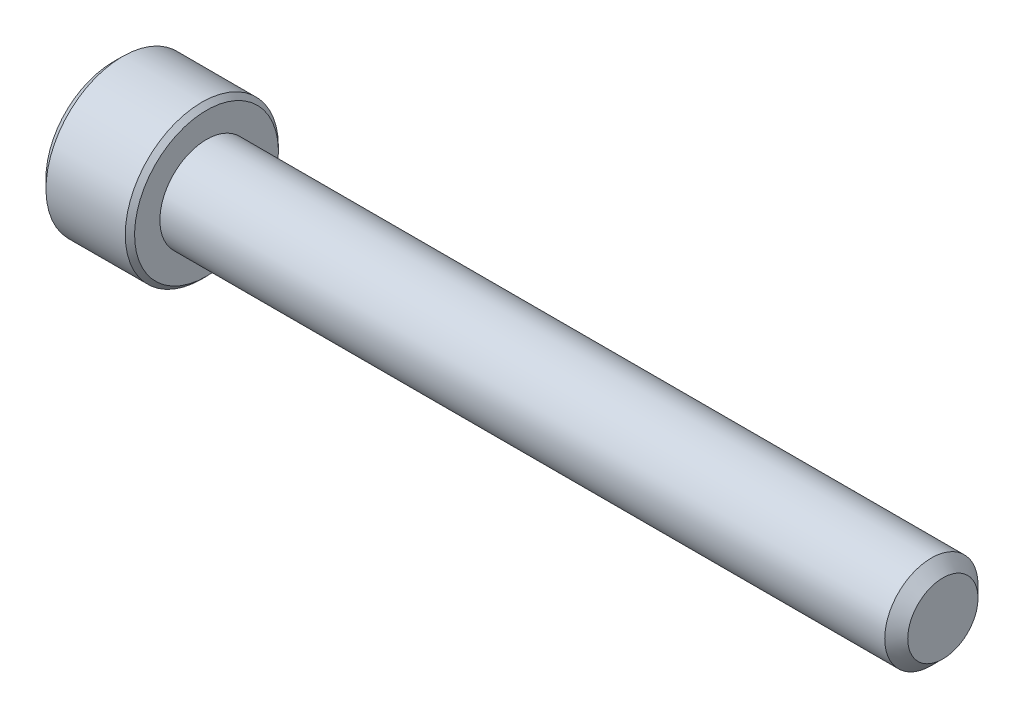
ISO-10303-21;
HEADER;
FILE_DESCRIPTION(('STEP AP214'),'2;1');
FILE_NAME('part.step','',(''),(''),'','','');
FILE_SCHEMA(('AUTOMOTIVE_DESIGN { 1 0 10303 214 1 1 1 1 }'));
ENDSEC;
DATA;
#1=APPLICATION_CONTEXT('core data for automotive mechanical design processes');
#2=APPLICATION_PROTOCOL_DEFINITION('international standard','automotive_design',2000,#1);
#3=PRODUCT_CONTEXT('',#1,'mechanical');
#4=PRODUCT('Part','Part','',(#3));
#5=PRODUCT_RELATED_PRODUCT_CATEGORY('part','',(#4));
#6=PRODUCT_DEFINITION_FORMATION('','',#4);
#7=PRODUCT_DEFINITION_CONTEXT('part definition',#1,'design');
#8=PRODUCT_DEFINITION('design','',#6,#7);
#9=PRODUCT_DEFINITION_SHAPE('','',#8);
#10=(LENGTH_UNIT() NAMED_UNIT(*) SI_UNIT(.MILLI.,.METRE.));
#11=(NAMED_UNIT(*) PLANE_ANGLE_UNIT() SI_UNIT($,.RADIAN.));
#12=(NAMED_UNIT(*) SI_UNIT($,.STERADIAN.) SOLID_ANGLE_UNIT());
#13=UNCERTAINTY_MEASURE_WITH_UNIT(LENGTH_MEASURE(1.E-05),#10,'distance_accuracy_value','');
#14=(GEOMETRIC_REPRESENTATION_CONTEXT(3) GLOBAL_UNCERTAINTY_ASSIGNED_CONTEXT((#13)) GLOBAL_UNIT_ASSIGNED_CONTEXT((#10,
#11,#12)) REPRESENTATION_CONTEXT('',''));
#15=CARTESIAN_POINT('',(0.,0.,0.));
#16=DIRECTION('',(0.,0.,1.));
#17=DIRECTION('',(1.,0.,0.));
#18=AXIS2_PLACEMENT_3D('',#15,#16,#17);
#19=CARTESIAN_POINT('',(-21.59,2.28769270663697,0.));
#20=DIRECTION('',(1.,0.,0.));
#21=DIRECTION('',(0.,0.,-1.));
#22=AXIS2_PLACEMENT_3D('',#19,#20,#21);
#23=PLANE('',#22);
#24=DIRECTION('',(0.,1.,0.));
#25=VECTOR('',#24,1.);
#26=CARTESIAN_POINT('',(-21.59,-1.14384635331849,-1.9812));
#27=LINE('',#26,#25);
#28=CARTESIAN_POINT('',(-21.59,-1.14384635331849,-1.9812));
#29=VERTEX_POINT('',#28);
#30=CARTESIAN_POINT('',(-21.59,1.14384635331849,-1.9812));
#31=VERTEX_POINT('',#30);
#32=EDGE_CURVE('E90',#29,#31,#27,.T.);
#33=ORIENTED_EDGE('',*,*,#32,.F.);
#34=DIRECTION('',(0.,-0.5,0.866025403784439));
#35=VECTOR('',#34,1.);
#36=CARTESIAN_POINT('',(-21.59,-2.28769270663697,0.));
#37=LINE('',#36,#35);
#38=CARTESIAN_POINT('',(-21.59,-2.28769270663692,0.));
#39=VERTEX_POINT('',#38);
#40=EDGE_CURVE('E88',#39,#29,#37,.F.);
#41=ORIENTED_EDGE('',*,*,#40,.F.);
#42=DIRECTION('',(0.,0.5,0.866025403784439));
#43=VECTOR('',#42,1.);
#44=CARTESIAN_POINT('',(-21.59,-1.14384635331849,1.9812));
#45=LINE('',#44,#43);
#46=CARTESIAN_POINT('',(-21.59,-1.14384635331849,1.9812));
#47=VERTEX_POINT('',#46);
#48=EDGE_CURVE('E68',#47,#39,#45,.F.);
#49=ORIENTED_EDGE('',*,*,#48,.F.);
#50=DIRECTION('',(0.,1.,0.));
#51=VECTOR('',#50,1.);
#52=CARTESIAN_POINT('',(-21.59,1.14384635331849,1.9812));
#53=LINE('',#52,#51);
#54=CARTESIAN_POINT('',(-21.59,1.14384635331848,1.9812));
#55=VERTEX_POINT('',#54);
#56=EDGE_CURVE('E107',#55,#47,#53,.F.);
#57=ORIENTED_EDGE('',*,*,#56,.F.);
#58=DIRECTION('',(0.,0.5,-0.866025403784439));
#59=VECTOR('',#58,1.);
#60=CARTESIAN_POINT('',(-21.59,2.28769270663697,0.));
#61=LINE('',#60,#59);
#62=CARTESIAN_POINT('',(-21.59,2.28769270663698,0.));
#63=VERTEX_POINT('',#62);
#64=EDGE_CURVE('E73',#63,#55,#61,.F.);
#65=ORIENTED_EDGE('',*,*,#64,.F.);
#66=DIRECTION('',(0.,-0.5,-0.866025403784439));
#67=VECTOR('',#66,1.);
#68=CARTESIAN_POINT('',(-21.59,1.14384635331849,-1.9812));
#69=LINE('',#68,#67);
#70=EDGE_CURVE('E115',#31,#63,#69,.F.);
#71=ORIENTED_EDGE('',*,*,#70,.F.);
#72=EDGE_LOOP('',(#33,#41,#49,#57,#65,#71));
#73=FACE_BOUND('',#72,.T.);
#74=ADVANCED_FACE('F17',(#73),#23,.F.);
#75=CARTESIAN_POINT('',(-21.59,-1.14384635331849,1.9812));
#76=DIRECTION('',(0.,0.866025403784439,-0.5));
#77=DIRECTION('',(0.,0.5,0.866025403784439));
#78=AXIS2_PLACEMENT_3D('',#75,#76,#77);
#79=PLANE('',#78);
#80=ORIENTED_EDGE('',*,*,#48,.T.);
#81=DIRECTION('',(1.,0.,0.));
#82=VECTOR('',#81,1.);
#83=CARTESIAN_POINT('',(-21.59,-2.2876927066369,-1.24131463938126E-13));
#84=LINE('',#83,#82);
#85=CARTESIAN_POINT('',(-23.8759999999097,-2.28769270665268,0.));
#86=VERTEX_POINT('',#85);
#87=EDGE_CURVE('E58',#86,#39,#84,.T.);
#88=ORIENTED_EDGE('',*,*,#87,.F.);
#89=CARTESIAN_POINT('',(-23.875999999917,-2.28769270663649,-3.23909531910409E-11));
#90=CARTESIAN_POINT('',(-23.8367231715198,-2.24837814885391,0.0680948115454177));
#91=CARTESIAN_POINT('',(-23.7997535182681,-2.20840625085198,0.137328169768456));
#92=CARTESIAN_POINT('',(-23.7320636614104,-2.12689944881423,0.278502092066733));
#93=CARTESIAN_POINT('',(-23.7013811081117,-2.08535679771273,0.350456074453279));
#94=CARTESIAN_POINT('',(-23.6488216878646,-2.0015880794742,0.495547750525627));
#95=CARTESIAN_POINT('',(-23.626812750451,-1.95938333420538,0.568648513652342));
#96=CARTESIAN_POINT('',(-23.592903790448,-1.87404496431856,0.716458906131875));
#97=CARTESIAN_POINT('',(-23.5809784655905,-1.83091394479085,0.791164023335938));
#98=CARTESIAN_POINT('',(-23.5702184619894,-1.75657564565178,0.919921734392981));
#99=CARTESIAN_POINT('',(-23.5686261142532,-1.7254643369951,0.97380810167633));
#100=CARTESIAN_POINT('',(-23.5713122030608,-1.66329262280389,1.08149266944917));
#101=CARTESIAN_POINT('',(-23.5755926973669,-1.63223223893117,1.13529083241932));
#102=CARTESIAN_POINT('',(-23.5897808786528,-1.570404805932,1.24237908767543));
#103=CARTESIAN_POINT('',(-23.5996948571084,-1.53963812394019,1.29566854406557));
#104=CARTESIAN_POINT('',(-23.6246058236765,-1.47863680820632,1.40132592224517));
#105=CARTESIAN_POINT('',(-23.6396024219634,-1.44840213384748,1.45369391438499));
#106=CARTESIAN_POINT('',(-23.684112301289,-1.37097621851473,1.58779953356383));
#107=CARTESIAN_POINT('',(-23.7169769783748,-1.32426457014328,1.66870648184849));
#108=CARTESIAN_POINT('',(-23.7724554571065,-1.25557868183891,1.78767393015465));
#109=CARTESIAN_POINT('',(-23.7919477927592,-1.23294354217948,1.82687914208121));
#110=CARTESIAN_POINT('',(-23.8327090770897,-1.18809237506183,1.90456364230774));
#111=CARTESIAN_POINT('',(-23.8539769369534,-1.16587610084023,1.94304335801443));
#112=CARTESIAN_POINT('',(-23.875999999909,-1.14384635330347,1.981200000026));
#113=B_SPLINE_CURVE_WITH_KNOTS('',3,(#89,#90,#91,#92,#93,#94,#95,#96,#97,#98,#99,#100,#101,#102,
#103,#104,#105,#106,#107,#108,#109,#110,#111,#112),.UNSPECIFIED.,.F.,.F.,(4,2,2,2,2,2,2,2,2,2,2,
4),(0.,0.263862053771174,0.529260821963846,0.790445955100976,1.05097374894045,1.23743842676391,
1.42396845590621,1.61070721238151,1.79743164964573,2.0939158774145,2.24175583204643,
2.3895057827315),.UNSPECIFIED.);
#114=CARTESIAN_POINT('',(-23.8759999999129,-1.14384635333276,1.98120000001359));
#115=VERTEX_POINT('',#114);
#116=EDGE_CURVE('E20',#86,#115,#113,.T.);
#117=ORIENTED_EDGE('',*,*,#116,.T.);
#118=DIRECTION('',(-1.,0.,0.));
#119=VECTOR('',#118,1.);
#120=CARTESIAN_POINT('',(-21.59,-1.14384635331849,1.9812));
#121=LINE('',#120,#119);
#122=EDGE_CURVE('E84',#47,#115,#121,.T.);
#123=ORIENTED_EDGE('',*,*,#122,.F.);
#124=EDGE_LOOP('',(#80,#88,#117,#123));
#125=FACE_BOUND('',#124,.T.);
#126=ADVANCED_FACE('F83',(#125),#79,.T.);
#127=CARTESIAN_POINT('',(-21.59,-2.28769270663697,0.));
#128=DIRECTION('',(0.,0.866025403784439,0.5));
#129=DIRECTION('',(0.,-0.5,0.866025403784439));
#130=AXIS2_PLACEMENT_3D('',#127,#128,#129);
#131=PLANE('',#130);
#132=ORIENTED_EDGE('',*,*,#40,.T.);
#133=DIRECTION('',(1.,0.,0.));
#134=VECTOR('',#133,1.);
#135=CARTESIAN_POINT('',(-21.59,-1.14384635331849,-1.9812));
#136=LINE('',#135,#134);
#137=CARTESIAN_POINT('',(-23.8759999999097,-1.14384635332635,-1.98120000001361));
#138=VERTEX_POINT('',#137);
#139=EDGE_CURVE('E93',#138,#29,#136,.T.);
#140=ORIENTED_EDGE('',*,*,#139,.F.);
#141=CARTESIAN_POINT('',(-23.8759999999169,-1.14384635329023,-1.98120000001579));
#142=CARTESIAN_POINT('',(-23.8367231715197,-1.18316091109122,-1.9131051884486));
#143=CARTESIAN_POINT('',(-23.799753518268,-1.22313280910071,-1.84387183022993));
#144=CARTESIAN_POINT('',(-23.7320636614104,-1.30463961114402,-1.70269790793487));
#145=CARTESIAN_POINT('',(-23.7013811081117,-1.34618226224348,-1.63074392554714));
#146=CARTESIAN_POINT('',(-23.6488216878646,-1.42995098048053,-1.48565224947395));
#147=CARTESIAN_POINT('',(-23.626812750451,-1.47215572574988,-1.41255148634755));
#148=CARTESIAN_POINT('',(-23.592903790448,-1.55749409563709,-1.26474109386824));
#149=CARTESIAN_POINT('',(-23.5809784655905,-1.60062511516465,-1.1900359766641));
#150=CARTESIAN_POINT('',(-23.5702184619894,-1.67496341430364,-1.06127826560701));
#151=CARTESIAN_POINT('',(-23.5686261142532,-1.70607472296034,-1.00739189832368));
#152=CARTESIAN_POINT('',(-23.5713122030608,-1.76824643715157,-0.899707330550847));
#153=CARTESIAN_POINT('',(-23.5755926973669,-1.79930682102429,-0.845909167580694));
#154=CARTESIAN_POINT('',(-23.5897808786528,-1.86113425402345,-0.738820912324577));
#155=CARTESIAN_POINT('',(-23.5996948571084,-1.89190093601526,-0.685531455934445));
#156=CARTESIAN_POINT('',(-23.6246058236766,-1.95290225174913,-0.57987407775484));
#157=CARTESIAN_POINT('',(-23.6396024219634,-1.98313692610798,-0.527506085615018));
#158=CARTESIAN_POINT('',(-23.684112301289,-2.06056284144072,-0.393400466436183));
#159=CARTESIAN_POINT('',(-23.7169769783748,-2.10727448981218,-0.312493518151523));
#160=CARTESIAN_POINT('',(-23.7724554571065,-2.17596037811654,-0.19352606984536));
#161=CARTESIAN_POINT('',(-23.7919477927592,-2.19859551777598,-0.154320857918803));
#162=CARTESIAN_POINT('',(-23.8327090770897,-2.24344668489363,-0.0766363576922705));
#163=CARTESIAN_POINT('',(-23.8539769369534,-2.26566295911523,-0.0381566419855778));
#164=CARTESIAN_POINT('',(-23.875999999909,-2.28769270665198,2.59943070280544E-11));
#165=B_SPLINE_CURVE_WITH_KNOTS('',3,(#141,#142,#143,#144,#145,#146,#147,#148,#149,#150,#151,
#152,#153,#154,#155,#156,#157,#158,#159,#160,#161,#162,#163,#164),.UNSPECIFIED.,.F.,.F.,(4,2,2,
2,2,2,2,2,2,2,2,4),(0.,0.263862053771165,0.529260821963824,0.790445955100943,1.05097374894041,
1.23743842676387,1.42396845590617,1.61070721238147,1.79743164964569,2.09391587741446,
2.2417558320464,2.38950578273147),.UNSPECIFIED.);
#166=EDGE_CURVE('E97',#138,#86,#165,.T.);
#167=ORIENTED_EDGE('',*,*,#166,.T.);
#168=ORIENTED_EDGE('',*,*,#87,.T.);
#169=EDGE_LOOP('',(#132,#140,#167,#168));
#170=FACE_BOUND('',#169,.T.);
#171=ADVANCED_FACE('F95',(#170),#131,.T.);
#172=CARTESIAN_POINT('',(-21.59,-1.14384635331849,-1.9812));
#173=DIRECTION('',(0.,0.,1.));
#174=DIRECTION('',(1.,0.,0.));
#175=AXIS2_PLACEMENT_3D('',#172,#173,#174);
#176=PLANE('',#175);
#177=ORIENTED_EDGE('',*,*,#32,.T.);
#178=DIRECTION('',(1.,0.,0.));
#179=VECTOR('',#178,1.);
#180=CARTESIAN_POINT('',(-21.59,1.14384635331848,-1.9812));
#181=LINE('',#180,#179);
#182=CARTESIAN_POINT('',(-23.8759999999096,1.14384635332635,-1.98120000001362));
#183=VERTEX_POINT('',#182);
#184=EDGE_CURVE('E117',#183,#31,#181,.T.);
#185=ORIENTED_EDGE('',*,*,#184,.F.);
#186=CARTESIAN_POINT('',(-23.8759999999169,1.14384635334631,-1.98119999998342));
#187=CARTESIAN_POINT('',(-23.8367231715197,1.06521723776272,-1.98119999999403));
#188=CARTESIAN_POINT('',(-23.799753518268,0.985273441751297,-1.9811999999984));
#189=CARTESIAN_POINT('',(-23.7320636614104,0.822259837670227,-1.98120000000161));
#190=CARTESIAN_POINT('',(-23.7013811081117,0.73917453546927,-1.98120000000043));
#191=CARTESIAN_POINT('',(-23.6488216878645,0.571637098993696,-1.98119999999958));
#192=CARTESIAN_POINT('',(-23.626812750451,0.487227608455526,-1.98119999999989));
#193=CARTESIAN_POINT('',(-23.5929037904479,0.316550868681495,-1.98120000000011));
#194=CARTESIAN_POINT('',(-23.5809784655905,0.230288829626232,-1.98120000000002));
#195=CARTESIAN_POINT('',(-23.5702184619894,0.0816122313481629,-1.98119999999998));
#196=CARTESIAN_POINT('',(-23.5686261142532,0.0193896140347859,-1.98119999999999));
#197=CARTESIAN_POINT('',(-23.5713122030608,-0.104953814347641,-1.9812));
#198=CARTESIAN_POINT('',(-23.5755926973668,-0.167074582093088,-1.9812));
#199=CARTESIAN_POINT('',(-23.5897808786528,-0.290729448091418,-1.9812));
#200=CARTESIAN_POINT('',(-23.5996948571084,-0.35226281207504,-1.9812));
#201=CARTESIAN_POINT('',(-23.6246058236765,-0.47426544354277,-1.9812));
#202=CARTESIAN_POINT('',(-23.6396024219633,-0.534734792260462,-1.9812));
#203=CARTESIAN_POINT('',(-23.684112301289,-0.689586622925962,-1.9812));
#204=CARTESIAN_POINT('',(-23.7169769783748,-0.783009919668897,-1.9812));
#205=CARTESIAN_POINT('',(-23.7724554571065,-0.920381696277656,-1.9812));
#206=CARTESIAN_POINT('',(-23.7919477927592,-0.965651975596532,-1.9812));
#207=CARTESIAN_POINT('',(-23.8327090770897,-1.05535430983185,-1.9812));
#208=CARTESIAN_POINT('',(-23.8539769369534,-1.09978685827506,-1.9812));
#209=CARTESIAN_POINT('',(-23.875999999909,-1.14384635334857,-1.9812));
#210=B_SPLINE_CURVE_WITH_KNOTS('',3,(#186,#187,#188,#189,#190,#191,#192,#193,#194,#195,#196,
#197,#198,#199,#200,#201,#202,#203,#204,#205,#206,#207,#208,#209),.UNSPECIFIED.,.F.,.F.,(4,2,2,
2,2,2,2,2,2,2,2,4),(0.,0.263862053771165,0.529260821963828,0.790445955100947,1.05097374894041,
1.23743842676387,1.42396845590617,1.61070721238147,1.79743164964569,2.09391587741451,
2.24175583204647,2.38950578273157),.UNSPECIFIED.);
#211=EDGE_CURVE('E199',#183,#138,#210,.T.);
#212=ORIENTED_EDGE('',*,*,#211,.T.);
#213=ORIENTED_EDGE('',*,*,#139,.T.);
#214=EDGE_LOOP('',(#177,#185,#212,#213));
#215=FACE_BOUND('',#214,.T.);
#216=ADVANCED_FACE('F188',(#215),#176,.T.);
#217=CARTESIAN_POINT('',(-21.59,1.14384635331849,-1.9812));
#218=DIRECTION('',(0.,-0.866025403784439,0.5));
#219=DIRECTION('',(0.,-0.5,-0.866025403784439));
#220=AXIS2_PLACEMENT_3D('',#217,#218,#219);
#221=PLANE('',#220);
#222=ORIENTED_EDGE('',*,*,#70,.T.);
#223=DIRECTION('',(1.,0.,0.));
#224=VECTOR('',#223,1.);
#225=CARTESIAN_POINT('',(-21.59,2.28769270663699,0.));
#226=LINE('',#225,#224);
#227=CARTESIAN_POINT('',(-23.8759999999096,2.28769270665271,0.));
#228=VERTEX_POINT('',#227);
#229=EDGE_CURVE('E112',#228,#63,#226,.T.);
#230=ORIENTED_EDGE('',*,*,#229,.F.);
#231=CARTESIAN_POINT('',(-23.8759999999169,2.28769270663654,3.23803637195144E-11));
#232=CARTESIAN_POINT('',(-23.8367231715197,2.24837814885393,-0.068094811545418));
#233=CARTESIAN_POINT('',(-23.799753518268,2.20840625085199,-0.137328169768451));
#234=CARTESIAN_POINT('',(-23.7320636614103,2.12689944881423,-0.278502092066724));
#235=CARTESIAN_POINT('',(-23.7013811081116,2.08535679771273,-0.350456074453271));
#236=CARTESIAN_POINT('',(-23.6488216878645,2.00158807947421,-0.495547750525619));
#237=CARTESIAN_POINT('',(-23.6268127504509,1.95938333420539,-0.568648513652333));
#238=CARTESIAN_POINT('',(-23.5929037904479,1.87404496431856,-0.716458906131865));
#239=CARTESIAN_POINT('',(-23.5809784655904,1.83091394479086,-0.791164023335926));
#240=CARTESIAN_POINT('',(-23.5702184619893,1.75657564565178,-0.919921734392968));
#241=CARTESIAN_POINT('',(-23.5686261142531,1.72546433699511,-0.973808101676315));
#242=CARTESIAN_POINT('',(-23.5713122030607,1.6632926228039,-1.08149266944915));
#243=CARTESIAN_POINT('',(-23.5755926973668,1.63223223893118,-1.1352908324193));
#244=CARTESIAN_POINT('',(-23.5897808786527,1.57040480593201,-1.24237908767541));
#245=CARTESIAN_POINT('',(-23.5996948571083,1.5396381239402,-1.29566854406554));
#246=CARTESIAN_POINT('',(-23.6246058236765,1.47863680820634,-1.40132592224515));
#247=CARTESIAN_POINT('',(-23.6396024219633,1.44840213384749,-1.45369391438497));
#248=CARTESIAN_POINT('',(-23.684112301289,1.37097621851474,-1.58779953356382));
#249=CARTESIAN_POINT('',(-23.7169769783747,1.32426457014327,-1.6687064818485));
#250=CARTESIAN_POINT('',(-23.7724554571065,1.25557868183889,-1.78767393015469));
#251=CARTESIAN_POINT('',(-23.7919477927591,1.23294354217945,-1.82687914208125));
#252=CARTESIAN_POINT('',(-23.8327090770897,1.18809237506179,-1.9045636423078));
#253=CARTESIAN_POINT('',(-23.8539769369534,1.16587610084019,-1.9430433580145));
#254=CARTESIAN_POINT('',(-23.875999999909,1.14384635330343,-1.98120000002608));
#255=B_SPLINE_CURVE_WITH_KNOTS('',3,(#231,#232,#233,#234,#235,#236,#237,#238,#239,#240,#241,
#242,#243,#244,#245,#246,#247,#248,#249,#250,#251,#252,#253,#254),.UNSPECIFIED.,.F.,.F.,(4,2,2,
2,2,2,2,2,2,2,2,4),(0.,0.26386205377117,0.529260821963842,0.790445955100968,1.05097374894044,
1.23743842676389,1.42396845590619,1.61070721238149,1.79743164964571,2.09391587741454,
2.24175583204651,2.38950578273161),.UNSPECIFIED.);
#256=EDGE_CURVE('E192',#228,#183,#255,.T.);
#257=ORIENTED_EDGE('',*,*,#256,.T.);
#258=ORIENTED_EDGE('',*,*,#184,.T.);
#259=EDGE_LOOP('',(#222,#230,#257,#258));
#260=FACE_BOUND('',#259,.T.);
#261=ADVANCED_FACE('F184',(#260),#221,.T.);
#262=CARTESIAN_POINT('',(-21.59,2.28769270663697,0.));
#263=DIRECTION('',(0.,-0.866025403784439,-0.5));
#264=DIRECTION('',(0.,0.5,-0.866025403784439));
#265=AXIS2_PLACEMENT_3D('',#262,#263,#264);
#266=PLANE('',#265);
#267=ORIENTED_EDGE('',*,*,#64,.T.);
#268=DIRECTION('',(-1.,0.,0.));
#269=VECTOR('',#268,1.);
#270=CARTESIAN_POINT('',(-21.59,1.14384635331848,1.9812));
#271=LINE('',#270,#269);
#272=CARTESIAN_POINT('',(-23.8759999999096,1.14384635332635,1.98120000001363));
#273=VERTEX_POINT('',#272);
#274=EDGE_CURVE('E39',#273,#55,#271,.F.);
#275=ORIENTED_EDGE('',*,*,#274,.F.);
#276=CARTESIAN_POINT('',(-23.8759999999169,1.14384635329021,1.98120000001581));
#277=CARTESIAN_POINT('',(-23.8367231715197,1.1831609110912,1.91310518844862));
#278=CARTESIAN_POINT('',(-23.799753518268,1.22313280910069,1.84387183022995));
#279=CARTESIAN_POINT('',(-23.7320636614103,1.30463961114402,1.70269790793488));
#280=CARTESIAN_POINT('',(-23.7013811081116,1.34618226224347,1.63074392554715));
#281=CARTESIAN_POINT('',(-23.6488216878645,1.42995098048053,1.48565224947395));
#282=CARTESIAN_POINT('',(-23.626812750451,1.47215572574988,1.41255148634754));
#283=CARTESIAN_POINT('',(-23.5929037904479,1.5574940956371,1.26474109386823));
#284=CARTESIAN_POINT('',(-23.5809784655905,1.60062511516466,1.19003597666408));
#285=CARTESIAN_POINT('',(-23.5702184619893,1.67496341430366,1.06127826560699));
#286=CARTESIAN_POINT('',(-23.5686261142531,1.70607472296036,1.00739189832365));
#287=CARTESIAN_POINT('',(-23.5713122030607,1.76824643715158,0.899707330550826));
#288=CARTESIAN_POINT('',(-23.5755926973668,1.7993068210243,0.845909167580675));
#289=CARTESIAN_POINT('',(-23.5897808786527,1.86113425402346,0.738820912324561));
#290=CARTESIAN_POINT('',(-23.5996948571083,1.89190093601527,0.685531455934431));
#291=CARTESIAN_POINT('',(-23.6246058236765,1.95290225174914,0.579874077754827));
#292=CARTESIAN_POINT('',(-23.6396024219633,1.98313692610798,0.527506085615006));
#293=CARTESIAN_POINT('',(-23.6841123012889,2.06056284144073,0.393400466436154));
#294=CARTESIAN_POINT('',(-23.7169769783747,2.1072744898122,0.312493518151477));
#295=CARTESIAN_POINT('',(-23.7724554571065,2.17596037811658,0.193526069845289));
#296=CARTESIAN_POINT('',(-23.7919477927591,2.19859551777602,0.154320857918724));
#297=CARTESIAN_POINT('',(-23.8327090770897,2.24344668489368,0.0766363576921754));
#298=CARTESIAN_POINT('',(-23.8539769369534,2.26566295911529,0.0381566419854743));
#299=CARTESIAN_POINT('',(-23.8759999999089,2.28769270665205,-2.6105858320905E-11));
#300=B_SPLINE_CURVE_WITH_KNOTS('',3,(#276,#277,#278,#279,#280,#281,#282,#283,#284,#285,#286,
#287,#288,#289,#290,#291,#292,#293,#294,#295,#296,#297,#298,#299),.UNSPECIFIED.,.F.,.F.,(4,2,2,
2,2,2,2,2,2,2,2,4),(0.,0.263862053771184,0.529260821963865,0.790445955101003,1.05097374894048,
1.23743842676394,1.42396845590623,1.61070721238154,1.79743164964575,2.09391587741458,
2.24175583204655,2.38950578273165),.UNSPECIFIED.);
#301=EDGE_CURVE('E163',#273,#228,#300,.T.);
#302=ORIENTED_EDGE('',*,*,#301,.T.);
#303=ORIENTED_EDGE('',*,*,#229,.T.);
#304=EDGE_LOOP('',(#267,#275,#302,#303));
#305=FACE_BOUND('',#304,.T.);
#306=ADVANCED_FACE('F177',(#305),#266,.T.);
#307=CARTESIAN_POINT('',(-21.59,1.14384635331849,1.9812));
#308=DIRECTION('',(0.,0.,-1.));
#309=DIRECTION('',(-1.,0.,0.));
#310=AXIS2_PLACEMENT_3D('',#307,#308,#309);
#311=PLANE('',#310);
#312=ORIENTED_EDGE('',*,*,#56,.T.);
#313=ORIENTED_EDGE('',*,*,#122,.T.);
#314=CARTESIAN_POINT('',(-23.875999999917,-1.14384635334633,1.9811999999834));
#315=CARTESIAN_POINT('',(-23.8367231715198,-1.06521723776274,1.98119999999403));
#316=CARTESIAN_POINT('',(-23.7997535182681,-0.985273441751311,1.9811999999984));
#317=CARTESIAN_POINT('',(-23.7320636614104,-0.822259837670231,1.98120000000161));
#318=CARTESIAN_POINT('',(-23.7013811081117,-0.739174535469267,1.98120000000043));
#319=CARTESIAN_POINT('',(-23.6488216878645,-0.57163709899368,1.98119999999958));
#320=CARTESIAN_POINT('',(-23.626812750451,-0.487227608455504,1.98119999999989));
#321=CARTESIAN_POINT('',(-23.5929037904479,-0.316550868681459,1.98120000000011));
#322=CARTESIAN_POINT('',(-23.5809784655905,-0.230288829626189,1.98120000000002));
#323=CARTESIAN_POINT('',(-23.5702184619894,-0.0816122313481128,1.98119999999998));
#324=CARTESIAN_POINT('',(-23.5686261142531,-0.0193896140347361,1.98119999999999));
#325=CARTESIAN_POINT('',(-23.5713122030608,0.104953814347691,1.9812));
#326=CARTESIAN_POINT('',(-23.5755926973668,0.167074582093138,1.9812));
#327=CARTESIAN_POINT('',(-23.5897808786528,0.290729448091469,1.9812));
#328=CARTESIAN_POINT('',(-23.5996948571084,0.352262812075091,1.9812));
#329=CARTESIAN_POINT('',(-23.6246058236765,0.474265443542822,1.9812));
#330=CARTESIAN_POINT('',(-23.6396024219633,0.534734792260514,1.9812));
#331=CARTESIAN_POINT('',(-23.684112301289,0.689586622926009,1.9812));
#332=CARTESIAN_POINT('',(-23.7169769783747,0.783009919668939,1.9812));
#333=CARTESIAN_POINT('',(-23.7724554571065,0.920381696277688,1.9812));
#334=CARTESIAN_POINT('',(-23.7919477927591,0.965651975596561,1.9812));
#335=CARTESIAN_POINT('',(-23.8327090770897,1.05535430983187,1.9812));
#336=CARTESIAN_POINT('',(-23.8539769369534,1.09978685827508,1.9812));
#337=CARTESIAN_POINT('',(-23.8759999999089,1.14384635334859,1.9812));
#338=B_SPLINE_CURVE_WITH_KNOTS('',3,(#314,#315,#316,#317,#318,#319,#320,#321,#322,#323,#324,
#325,#326,#327,#328,#329,#330,#331,#332,#333,#334,#335,#336,#337),.UNSPECIFIED.,.F.,.F.,(4,2,2,
2,2,2,2,2,2,2,2,4),(0.,0.263862053771187,0.529260821963873,0.790445955101016,1.0509737489405,
1.23743842676396,1.42396845590626,1.61070721238156,1.79743164964578,2.09391587741458,
2.24175583204653,2.38950578273162),.UNSPECIFIED.);
#339=EDGE_CURVE('E156',#115,#273,#338,.T.);
#340=ORIENTED_EDGE('',*,*,#339,.T.);
#341=ORIENTED_EDGE('',*,*,#274,.T.);
#342=EDGE_LOOP('',(#312,#313,#340,#341));
#343=FACE_BOUND('',#342,.T.);
#344=ADVANCED_FACE('F173',(#343),#311,.T.);
#345=CARTESIAN_POINT('',(-23.8759999998592,0.,0.));
#346=DIRECTION('',(-1.,0.,0.));
#347=DIRECTION('',(0.,-1.,0.));
#348=AXIS2_PLACEMENT_3D('',#345,#346,#347);
#349=CONICAL_SURFACE('',#348,2.28769270660227,0.785398163397455);
#350=CARTESIAN_POINT('',(-23.8759999999161,0.,0.));
#351=DIRECTION('',(-1.,0.,0.));
#352=DIRECTION('',(0.,-1.,0.));
#353=AXIS2_PLACEMENT_3D('',#350,#351,#352);
#354=CIRCLE('',#353,2.28769270665912);
#355=EDGE_CURVE('E153',#115,#86,#354,.F.);
#356=ORIENTED_EDGE('',*,*,#355,.F.);
#357=ORIENTED_EDGE('',*,*,#116,.F.);
#358=EDGE_LOOP('',(#356,#357));
#359=FACE_BOUND('',#358,.T.);
#360=ADVANCED_FACE('F176',(#359),#349,.F.);
#361=CARTESIAN_POINT('',(-23.8759999998592,0.,0.));
#362=DIRECTION('',(-1.,0.,0.));
#363=DIRECTION('',(0.,-1.,0.));
#364=AXIS2_PLACEMENT_3D('',#361,#362,#363);
#365=CONICAL_SURFACE('',#364,2.28769270660227,0.785398163397455);
#366=CARTESIAN_POINT('',(-23.8759999999161,0.,0.));
#367=DIRECTION('',(-1.,0.,0.));
#368=DIRECTION('',(0.,-1.,0.));
#369=AXIS2_PLACEMENT_3D('',#366,#367,#368);
#370=CIRCLE('',#369,2.28769270665912);
#371=EDGE_CURVE('E150',#86,#138,#370,.F.);
#372=ORIENTED_EDGE('',*,*,#371,.F.);
#373=ORIENTED_EDGE('',*,*,#166,.F.);
#374=EDGE_LOOP('',(#372,#373));
#375=FACE_BOUND('',#374,.T.);
#376=ADVANCED_FACE('F213',(#375),#365,.F.);
#377=CARTESIAN_POINT('',(-23.8759999998592,0.,0.));
#378=DIRECTION('',(-1.,0.,0.));
#379=DIRECTION('',(0.,-1.,0.));
#380=AXIS2_PLACEMENT_3D('',#377,#378,#379);
#381=CONICAL_SURFACE('',#380,2.28769270660227,0.785398163397455);
#382=CARTESIAN_POINT('',(-23.8759999999161,0.,0.));
#383=DIRECTION('',(-1.,0.,0.));
#384=DIRECTION('',(0.,-1.,0.));
#385=AXIS2_PLACEMENT_3D('',#382,#383,#384);
#386=CIRCLE('',#385,2.28769270665912);
#387=EDGE_CURVE('E147',#138,#183,#386,.F.);
#388=ORIENTED_EDGE('',*,*,#387,.F.);
#389=ORIENTED_EDGE('',*,*,#211,.F.);
#390=EDGE_LOOP('',(#388,#389));
#391=FACE_BOUND('',#390,.T.);
#392=ADVANCED_FACE('F208',(#391),#381,.F.);
#393=CARTESIAN_POINT('',(-23.8759999998592,0.,0.));
#394=DIRECTION('',(-1.,0.,0.));
#395=DIRECTION('',(0.,-1.,0.));
#396=AXIS2_PLACEMENT_3D('',#393,#394,#395);
#397=CONICAL_SURFACE('',#396,2.28769270660227,0.785398163397455);
#398=CARTESIAN_POINT('',(-23.8759999999161,0.,0.));
#399=DIRECTION('',(-1.,0.,0.));
#400=DIRECTION('',(0.,-1.,0.));
#401=AXIS2_PLACEMENT_3D('',#398,#399,#400);
#402=CIRCLE('',#401,2.28769270665912);
#403=EDGE_CURVE('E144',#183,#228,#402,.F.);
#404=ORIENTED_EDGE('',*,*,#403,.F.);
#405=ORIENTED_EDGE('',*,*,#256,.F.);
#406=EDGE_LOOP('',(#404,#405));
#407=FACE_BOUND('',#406,.T.);
#408=ADVANCED_FACE('F204',(#407),#397,.F.);
#409=CARTESIAN_POINT('',(-23.8759999998592,0.,0.));
#410=DIRECTION('',(-1.,0.,0.));
#411=DIRECTION('',(0.,-1.,0.));
#412=AXIS2_PLACEMENT_3D('',#409,#410,#411);
#413=CONICAL_SURFACE('',#412,2.28769270660227,0.785398163397455);
#414=CARTESIAN_POINT('',(-23.8759999999161,0.,0.));
#415=DIRECTION('',(-1.,0.,0.));
#416=DIRECTION('',(0.,-1.,0.));
#417=AXIS2_PLACEMENT_3D('',#414,#415,#416);
#418=CIRCLE('',#417,2.28769270665912);
#419=EDGE_CURVE('E141',#228,#273,#418,.F.);
#420=ORIENTED_EDGE('',*,*,#419,.F.);
#421=ORIENTED_EDGE('',*,*,#301,.F.);
#422=EDGE_LOOP('',(#420,#421));
#423=FACE_BOUND('',#422,.T.);
#424=ADVANCED_FACE('F207',(#423),#413,.F.);
#425=CARTESIAN_POINT('',(-23.8759999998592,0.,0.));
#426=DIRECTION('',(-1.,0.,0.));
#427=DIRECTION('',(0.,-1.,0.));
#428=AXIS2_PLACEMENT_3D('',#425,#426,#427);
#429=CONICAL_SURFACE('',#428,2.28769270660227,0.785398163397455);
#430=CARTESIAN_POINT('',(-23.8759999999161,0.,0.));
#431=DIRECTION('',(-1.,0.,0.));
#432=DIRECTION('',(0.,-1.,0.));
#433=AXIS2_PLACEMENT_3D('',#430,#431,#432);
#434=CIRCLE('',#433,2.28769270665912);
#435=EDGE_CURVE('E138',#273,#115,#434,.F.);
#436=ORIENTED_EDGE('',*,*,#435,.F.);
#437=ORIENTED_EDGE('',*,*,#339,.F.);
#438=EDGE_LOOP('',(#436,#437));
#439=FACE_BOUND('',#438,.T.);
#440=ADVANCED_FACE('F170',(#439),#429,.F.);
#441=CARTESIAN_POINT('',(-23.876,3.47979999999999,0.));
#442=DIRECTION('',(-1.,0.,0.));
#443=DIRECTION('',(0.,-1.,0.));
#444=AXIS2_PLACEMENT_3D('',#441,#442,#443);
#445=PLANE('',#444);
#446=CARTESIAN_POINT('',(-23.8759999999729,0.,0.));
#447=DIRECTION('',(1.,0.,0.));
#448=DIRECTION('',(0.,1.,0.));
#449=AXIS2_PLACEMENT_3D('',#446,#447,#448);
#450=CIRCLE('',#449,3.4797999999796);
#451=CARTESIAN_POINT('',(-23.8759999999729,3.4797999999796,0.));
#452=VERTEX_POINT('',#451);
#453=EDGE_CURVE('E134',#452,#452,#450,.T.);
#454=ORIENTED_EDGE('',*,*,#453,.F.);
#455=EDGE_LOOP('',(#454));
#456=FACE_BOUND('',#455,.T.);
#457=ORIENTED_EDGE('',*,*,#419,.T.);
#458=ORIENTED_EDGE('',*,*,#435,.T.);
#459=ORIENTED_EDGE('',*,*,#355,.T.);
#460=ORIENTED_EDGE('',*,*,#371,.T.);
#461=ORIENTED_EDGE('',*,*,#387,.T.);
#462=ORIENTED_EDGE('',*,*,#403,.T.);
#463=EDGE_LOOP('',(#457,#458,#459,#460,#461,#462));
#464=FACE_BOUND('',#463,.T.);
#465=ADVANCED_FACE('F259',(#456,#464),#445,.T.);
#466=CARTESIAN_POINT('',(-23.3933999998612,0.,0.));
#467=DIRECTION('',(1.,0.,0.));
#468=DIRECTION('',(0.,1.,0.));
#469=AXIS2_PLACEMENT_3D('',#466,#467,#468);
#470=CONICAL_SURFACE('',#469,3.96240000009129,0.785398163397453);
#471=CARTESIAN_POINT('',(-23.3934,0.,0.));
#472=DIRECTION('',(1.,0.,0.));
#473=DIRECTION('',(0.,1.,0.));
#474=AXIS2_PLACEMENT_3D('',#471,#472,#473);
#475=CIRCLE('',#474,3.9624);
#476=CARTESIAN_POINT('',(-23.3934,3.9624,0.));
#477=VERTEX_POINT('',#476);
#478=EDGE_CURVE('E137',#477,#477,#475,.T.);
#479=ORIENTED_EDGE('',*,*,#478,.F.);
#480=EDGE_LOOP('',(#479));
#481=FACE_BOUND('',#480,.T.);
#482=ORIENTED_EDGE('',*,*,#453,.T.);
#483=EDGE_LOOP('',(#482));
#484=FACE_BOUND('',#483,.T.);
#485=ADVANCED_FACE('F256',(#481,#484),#470,.T.);
#486=CARTESIAN_POINT('',(-19.05,0.,0.));
#487=DIRECTION('',(1.,0.,0.));
#488=DIRECTION('',(0.,1.,0.));
#489=AXIS2_PLACEMENT_3D('',#486,#487,#488);
#490=CYLINDRICAL_SURFACE('',#489,3.9624);
#491=CARTESIAN_POINT('',(-19.2913000000203,0.,0.));
#492=DIRECTION('',(-1.,0.,0.));
#493=DIRECTION('',(0.,-1.,0.));
#494=AXIS2_PLACEMENT_3D('',#491,#492,#493);
#495=CIRCLE('',#494,3.96240000003444);
#496=CARTESIAN_POINT('',(-19.2913000000203,-3.96240000003445,0.));
#497=VERTEX_POINT('',#496);
#498=EDGE_CURVE('E133',#497,#497,#495,.F.);
#499=ORIENTED_EDGE('',*,*,#498,.F.);
#500=EDGE_LOOP('',(#499));
#501=FACE_BOUND('',#500,.T.);
#502=ORIENTED_EDGE('',*,*,#478,.T.);
#503=EDGE_LOOP('',(#502));
#504=FACE_BOUND('',#503,.T.);
#505=ADVANCED_FACE('F252',(#501,#504),#490,.T.);
#506=CARTESIAN_POINT('',(-19.2912999999066,0.,0.));
#507=DIRECTION('',(-1.,0.,0.));
#508=DIRECTION('',(0.,-1.,0.));
#509=AXIS2_PLACEMENT_3D('',#506,#507,#508);
#510=CONICAL_SURFACE('',#509,3.96239999992076,0.785398163397449);
#511=ORIENTED_EDGE('',*,*,#498,.T.);
#512=EDGE_LOOP('',(#511));
#513=FACE_BOUND('',#512,.T.);
#514=CARTESIAN_POINT('',(-19.0499999999929,0.,0.));
#515=DIRECTION('',(-1.,0.,0.));
#516=DIRECTION('',(0.,-1.,0.));
#517=AXIS2_PLACEMENT_3D('',#514,#515,#516);
#518=CIRCLE('',#517,3.72110000000703);
#519=CARTESIAN_POINT('',(-19.0499999999929,-3.72110000000703,0.));
#520=VERTEX_POINT('',#519);
#521=EDGE_CURVE('E130',#520,#520,#518,.F.);
#522=ORIENTED_EDGE('',*,*,#521,.F.);
#523=EDGE_LOOP('',(#522));
#524=FACE_BOUND('',#523,.T.);
#525=ADVANCED_FACE('F248',(#513,#524),#510,.T.);
#526=CARTESIAN_POINT('',(19.05,0.,0.));
#527=DIRECTION('',(1.,0.,0.));
#528=DIRECTION('',(0.,0.,-1.));
#529=AXIS2_PLACEMENT_3D('',#526,#527,#528);
#530=PLANE('',#529);
#531=CARTESIAN_POINT('',(19.0500000000497,0.,0.));
#532=DIRECTION('',(-1.,0.,0.));
#533=DIRECTION('',(0.,0.,1.));
#534=AXIS2_PLACEMENT_3D('',#531,#532,#533);
#535=CIRCLE('',#534,1.81768749996536);
#536=CARTESIAN_POINT('',(19.0500000000497,0.,1.81768749996536));
#537=VERTEX_POINT('',#536);
#538=EDGE_CURVE('E127',#537,#537,#535,.T.);
#539=ORIENTED_EDGE('',*,*,#538,.F.);
#540=EDGE_LOOP('',(#539));
#541=FACE_BOUND('',#540,.T.);
#542=ADVANCED_FACE('F244',(#541),#530,.T.);
#543=CARTESIAN_POINT('',(-19.05,3.72109999999999,0.));
#544=DIRECTION('',(1.,0.,0.));
#545=DIRECTION('',(0.,1.,0.));
#546=AXIS2_PLACEMENT_3D('',#543,#544,#545);
#547=PLANE('',#546);
#548=ORIENTED_EDGE('',*,*,#521,.T.);
#549=EDGE_LOOP('',(#548));
#550=FACE_BOUND('',#549,.T.);
#551=CARTESIAN_POINT('',(-19.05,0.,0.));
#552=DIRECTION('',(1.,0.,0.));
#553=DIRECTION('',(0.,0.,-1.));
#554=AXIS2_PLACEMENT_3D('',#551,#552,#553);
#555=CIRCLE('',#554,2.41299999999999);
#556=CARTESIAN_POINT('',(-19.05,0.,-2.41299999999999));
#557=VERTEX_POINT('',#556);
#558=EDGE_CURVE('E30',#557,#557,#555,.T.);
#559=ORIENTED_EDGE('',*,*,#558,.F.);
#560=EDGE_LOOP('',(#559));
#561=FACE_BOUND('',#560,.T.);
#562=ADVANCED_FACE('F237',(#550,#561),#547,.T.);
#563=CARTESIAN_POINT('',(18.4546875001388,0.,0.));
#564=DIRECTION('',(-1.,0.,0.));
#565=DIRECTION('',(0.,0.,1.));
#566=AXIS2_PLACEMENT_3D('',#563,#564,#565);
#567=CONICAL_SURFACE('',#566,2.41299999987632,0.785398163397448);
#568=CARTESIAN_POINT('',(18.4546875,0.,0.));
#569=DIRECTION('',(1.,0.,0.));
#570=DIRECTION('',(0.,0.,-1.));
#571=AXIS2_PLACEMENT_3D('',#568,#569,#570);
#572=CIRCLE('',#571,2.41299999999999);
#573=CARTESIAN_POINT('',(18.4546875,0.,-2.41299999999999));
#574=VERTEX_POINT('',#573);
#575=EDGE_CURVE('E11',#574,#574,#572,.F.);
#576=ORIENTED_EDGE('',*,*,#575,.F.);
#577=EDGE_LOOP('',(#576));
#578=FACE_BOUND('',#577,.T.);
#579=ORIENTED_EDGE('',*,*,#538,.T.);
#580=EDGE_LOOP('',(#579));
#581=FACE_BOUND('',#580,.T.);
#582=ADVANCED_FACE('F231',(#578,#581),#567,.T.);
#583=CARTESIAN_POINT('',(-19.05,0.,0.));
#584=DIRECTION('',(1.,0.,0.));
#585=DIRECTION('',(0.,0.,-1.));
#586=AXIS2_PLACEMENT_3D('',#583,#584,#585);
#587=CYLINDRICAL_SURFACE('',#586,2.41299999999999);
#588=ORIENTED_EDGE('',*,*,#575,.T.);
#589=EDGE_LOOP('',(#588));
#590=FACE_BOUND('',#589,.T.);
#591=ORIENTED_EDGE('',*,*,#558,.T.);
#592=EDGE_LOOP('',(#591));
#593=FACE_BOUND('',#592,.T.);
#594=ADVANCED_FACE('F229',(#590,#593),#587,.T.);
#595=CLOSED_SHELL('',(#74,#126,#171,#216,#261,#306,#344,#360,#376,#392,#408,#424,#440,#465,#485,
#505,#525,#542,#562,#582,#594));
#596=MANIFOLD_SOLID_BREP('B1',#595);
#597=ADVANCED_BREP_SHAPE_REPRESENTATION('',(#18,#596),#14);
#598=SHAPE_DEFINITION_REPRESENTATION(#9,#597);
ENDSEC;
END-ISO-10303-21;
